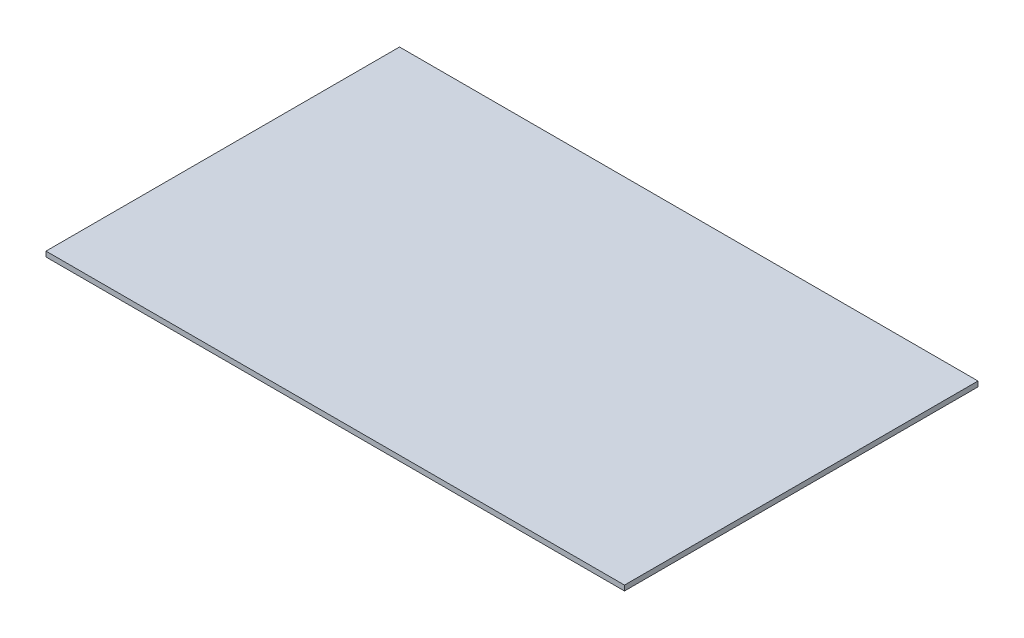
ISO-10303-21;
HEADER;
FILE_DESCRIPTION(('STEP AP214'),'2;1');
FILE_NAME('part.step','',(''),(''),'','','');
FILE_SCHEMA(('AUTOMOTIVE_DESIGN { 1 0 10303 214 1 1 1 1 }'));
ENDSEC;
DATA;
#1=APPLICATION_CONTEXT('core data for automotive mechanical design processes');
#2=APPLICATION_PROTOCOL_DEFINITION('international standard','automotive_design',2000,#1);
#3=PRODUCT_CONTEXT('',#1,'mechanical');
#4=PRODUCT('Part','Part','',(#3));
#5=PRODUCT_RELATED_PRODUCT_CATEGORY('part','',(#4));
#6=PRODUCT_DEFINITION_FORMATION('','',#4);
#7=PRODUCT_DEFINITION_CONTEXT('part definition',#1,'design');
#8=PRODUCT_DEFINITION('design','',#6,#7);
#9=PRODUCT_DEFINITION_SHAPE('','',#8);
#10=(LENGTH_UNIT() NAMED_UNIT(*) SI_UNIT(.MILLI.,.METRE.));
#11=(NAMED_UNIT(*) PLANE_ANGLE_UNIT() SI_UNIT($,.RADIAN.));
#12=(NAMED_UNIT(*) SI_UNIT($,.STERADIAN.) SOLID_ANGLE_UNIT());
#13=UNCERTAINTY_MEASURE_WITH_UNIT(LENGTH_MEASURE(1.E-05),#10,'distance_accuracy_value','');
#14=(GEOMETRIC_REPRESENTATION_CONTEXT(3) GLOBAL_UNCERTAINTY_ASSIGNED_CONTEXT((#13)) GLOBAL_UNIT_ASSIGNED_CONTEXT((#10,
#11,#12)) REPRESENTATION_CONTEXT('',''));
#15=CARTESIAN_POINT('',(0.,0.,0.));
#16=DIRECTION('',(0.,0.,1.));
#17=DIRECTION('',(1.,0.,0.));
#18=AXIS2_PLACEMENT_3D('',#15,#16,#17);
#19=CARTESIAN_POINT('',(-90.,1.6,-55.));
#20=DIRECTION('',(0.,0.,1.));
#21=DIRECTION('',(1.,0.,0.));
#22=AXIS2_PLACEMENT_3D('',#19,#20,#21);
#23=PLANE('',#22);
#24=DIRECTION('',(-1.,0.,0.));
#25=VECTOR('',#24,1.);
#26=CARTESIAN_POINT('',(-90.,0.,-55.));
#27=LINE('',#26,#25);
#28=CARTESIAN_POINT('',(90.,0.,-55.));
#29=VERTEX_POINT('',#28);
#30=CARTESIAN_POINT('',(-90.,0.,-55.));
#31=VERTEX_POINT('',#30);
#32=EDGE_CURVE('E107',#29,#31,#27,.T.);
#33=ORIENTED_EDGE('',*,*,#32,.T.);
#34=DIRECTION('',(0.,-1.,0.));
#35=VECTOR('',#34,1.);
#36=CARTESIAN_POINT('',(-90.,1.6,-55.));
#37=LINE('',#36,#35);
#38=CARTESIAN_POINT('',(-90.,1.6,-55.));
#39=VERTEX_POINT('',#38);
#40=EDGE_CURVE('E11',#39,#31,#37,.T.);
#41=ORIENTED_EDGE('',*,*,#40,.F.);
#42=DIRECTION('',(-1.,0.,0.));
#43=VECTOR('',#42,1.);
#44=CARTESIAN_POINT('',(-90.,1.6,-55.));
#45=LINE('',#44,#43);
#46=CARTESIAN_POINT('',(90.,1.6,-55.));
#47=VERTEX_POINT('',#46);
#48=EDGE_CURVE('E91',#47,#39,#45,.T.);
#49=ORIENTED_EDGE('',*,*,#48,.F.);
#50=DIRECTION('',(0.,-1.,0.));
#51=VECTOR('',#50,1.);
#52=CARTESIAN_POINT('',(90.,1.6,-55.));
#53=LINE('',#52,#51);
#54=EDGE_CURVE('E103',#47,#29,#53,.T.);
#55=ORIENTED_EDGE('',*,*,#54,.T.);
#56=EDGE_LOOP('',(#33,#41,#49,#55));
#57=FACE_BOUND('',#56,.T.);
#58=ADVANCED_FACE('F39',(#57),#23,.F.);
#59=CARTESIAN_POINT('',(-90.,1.6,55.));
#60=DIRECTION('',(1.,0.,0.));
#61=DIRECTION('',(0.,0.,-1.));
#62=AXIS2_PLACEMENT_3D('',#59,#60,#61);
#63=PLANE('',#62);
#64=DIRECTION('',(0.,0.,1.));
#65=VECTOR('',#64,1.);
#66=CARTESIAN_POINT('',(-90.,0.,55.));
#67=LINE('',#66,#65);
#68=CARTESIAN_POINT('',(-90.,0.,55.));
#69=VERTEX_POINT('',#68);
#70=EDGE_CURVE('E96',#31,#69,#67,.T.);
#71=ORIENTED_EDGE('',*,*,#70,.T.);
#72=DIRECTION('',(0.,-1.,0.));
#73=VECTOR('',#72,1.);
#74=CARTESIAN_POINT('',(-90.,1.6,55.));
#75=LINE('',#74,#73);
#76=CARTESIAN_POINT('',(-90.,1.6,55.));
#77=VERTEX_POINT('',#76);
#78=EDGE_CURVE('E48',#77,#69,#75,.T.);
#79=ORIENTED_EDGE('',*,*,#78,.F.);
#80=DIRECTION('',(0.,0.,1.));
#81=VECTOR('',#80,1.);
#82=CARTESIAN_POINT('',(-90.,1.6,55.));
#83=LINE('',#82,#81);
#84=EDGE_CURVE('E86',#39,#77,#83,.T.);
#85=ORIENTED_EDGE('',*,*,#84,.F.);
#86=ORIENTED_EDGE('',*,*,#40,.T.);
#87=EDGE_LOOP('',(#71,#79,#85,#86));
#88=FACE_BOUND('',#87,.T.);
#89=ADVANCED_FACE('F95',(#88),#63,.F.);
#90=CARTESIAN_POINT('',(-90.,1.6,55.));
#91=DIRECTION('',(0.,0.,-1.));
#92=DIRECTION('',(-1.,0.,0.));
#93=AXIS2_PLACEMENT_3D('',#90,#91,#92);
#94=PLANE('',#93);
#95=DIRECTION('',(1.,0.,0.));
#96=VECTOR('',#95,1.);
#97=CARTESIAN_POINT('',(-90.,0.,55.));
#98=LINE('',#97,#96);
#99=CARTESIAN_POINT('',(90.,0.,55.));
#100=VERTEX_POINT('',#99);
#101=EDGE_CURVE('E73',#69,#100,#98,.T.);
#102=ORIENTED_EDGE('',*,*,#101,.T.);
#103=DIRECTION('',(0.,-1.,0.));
#104=VECTOR('',#103,1.);
#105=CARTESIAN_POINT('',(90.,1.6,55.));
#106=LINE('',#105,#104);
#107=CARTESIAN_POINT('',(90.,1.6,55.));
#108=VERTEX_POINT('',#107);
#109=EDGE_CURVE('E98',#108,#100,#106,.T.);
#110=ORIENTED_EDGE('',*,*,#109,.F.);
#111=DIRECTION('',(1.,0.,0.));
#112=VECTOR('',#111,1.);
#113=CARTESIAN_POINT('',(-90.,1.6,55.));
#114=LINE('',#113,#112);
#115=EDGE_CURVE('E89',#77,#108,#114,.T.);
#116=ORIENTED_EDGE('',*,*,#115,.F.);
#117=ORIENTED_EDGE('',*,*,#78,.T.);
#118=EDGE_LOOP('',(#102,#110,#116,#117));
#119=FACE_BOUND('',#118,.T.);
#120=ADVANCED_FACE('F99',(#119),#94,.F.);
#121=CARTESIAN_POINT('',(90.,1.6,55.));
#122=DIRECTION('',(-1.,0.,0.));
#123=DIRECTION('',(0.,0.,1.));
#124=AXIS2_PLACEMENT_3D('',#121,#122,#123);
#125=PLANE('',#124);
#126=DIRECTION('',(0.,0.,-1.));
#127=VECTOR('',#126,1.);
#128=CARTESIAN_POINT('',(90.,0.,55.));
#129=LINE('',#128,#127);
#130=EDGE_CURVE('E79',#100,#29,#129,.T.);
#131=ORIENTED_EDGE('',*,*,#130,.T.);
#132=ORIENTED_EDGE('',*,*,#54,.F.);
#133=DIRECTION('',(0.,0.,-1.));
#134=VECTOR('',#133,1.);
#135=CARTESIAN_POINT('',(90.,1.6,55.));
#136=LINE('',#135,#134);
#137=EDGE_CURVE('E56',#108,#47,#136,.T.);
#138=ORIENTED_EDGE('',*,*,#137,.F.);
#139=ORIENTED_EDGE('',*,*,#109,.T.);
#140=EDGE_LOOP('',(#131,#132,#138,#139));
#141=FACE_BOUND('',#140,.T.);
#142=ADVANCED_FACE('F120',(#141),#125,.F.);
#143=CARTESIAN_POINT('',(0.,1.6,0.));
#144=DIRECTION('',(0.,1.,0.));
#145=DIRECTION('',(0.,0.,1.));
#146=AXIS2_PLACEMENT_3D('',#143,#144,#145);
#147=PLANE('',#146);
#148=ORIENTED_EDGE('',*,*,#48,.T.);
#149=ORIENTED_EDGE('',*,*,#84,.T.);
#150=ORIENTED_EDGE('',*,*,#115,.T.);
#151=ORIENTED_EDGE('',*,*,#137,.T.);
#152=EDGE_LOOP('',(#148,#149,#150,#151));
#153=FACE_BOUND('',#152,.T.);
#154=ADVANCED_FACE('F87',(#153),#147,.T.);
#155=CARTESIAN_POINT('',(0.,0.,0.));
#156=DIRECTION('',(0.,1.,0.));
#157=DIRECTION('',(0.,0.,1.));
#158=AXIS2_PLACEMENT_3D('',#155,#156,#157);
#159=PLANE('',#158);
#160=ORIENTED_EDGE('',*,*,#32,.F.);
#161=ORIENTED_EDGE('',*,*,#130,.F.);
#162=ORIENTED_EDGE('',*,*,#101,.F.);
#163=ORIENTED_EDGE('',*,*,#70,.F.);
#164=EDGE_LOOP('',(#160,#161,#162,#163));
#165=FACE_BOUND('',#164,.T.);
#166=ADVANCED_FACE('F123',(#165),#159,.F.);
#167=CLOSED_SHELL('',(#58,#89,#120,#142,#154,#166));
#168=MANIFOLD_SOLID_BREP('B2',#167);
#169=ADVANCED_BREP_SHAPE_REPRESENTATION('',(#18,#168),#14);
#170=SHAPE_DEFINITION_REPRESENTATION(#9,#169);
ENDSEC;
END-ISO-10303-21;
